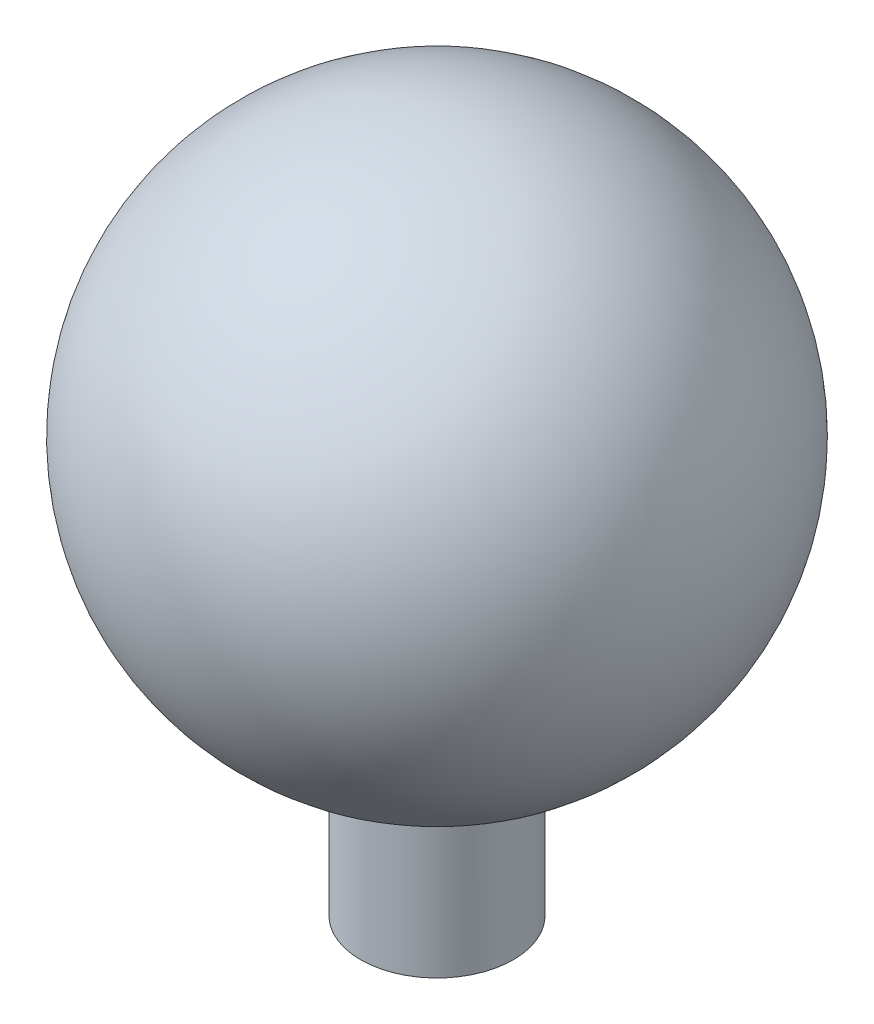
ISO-10303-21;
HEADER;
FILE_DESCRIPTION(('STEP AP214'),'2;1');
FILE_NAME('part.step','',(''),(''),'','','');
FILE_SCHEMA(('AUTOMOTIVE_DESIGN { 1 0 10303 214 1 1 1 1 }'));
ENDSEC;
DATA;
#1=APPLICATION_CONTEXT('core data for automotive mechanical design processes');
#2=APPLICATION_PROTOCOL_DEFINITION('international standard','automotive_design',2000,#1);
#3=PRODUCT_CONTEXT('',#1,'mechanical');
#4=PRODUCT('Part','Part','',(#3));
#5=PRODUCT_RELATED_PRODUCT_CATEGORY('part','',(#4));
#6=PRODUCT_DEFINITION_FORMATION('','',#4);
#7=PRODUCT_DEFINITION_CONTEXT('part definition',#1,'design');
#8=PRODUCT_DEFINITION('design','',#6,#7);
#9=PRODUCT_DEFINITION_SHAPE('','',#8);
#10=(LENGTH_UNIT() NAMED_UNIT(*) SI_UNIT(.MILLI.,.METRE.));
#11=(NAMED_UNIT(*) PLANE_ANGLE_UNIT() SI_UNIT($,.RADIAN.));
#12=(NAMED_UNIT(*) SI_UNIT($,.STERADIAN.) SOLID_ANGLE_UNIT());
#13=UNCERTAINTY_MEASURE_WITH_UNIT(LENGTH_MEASURE(1.E-05),#10,'distance_accuracy_value','');
#14=(GEOMETRIC_REPRESENTATION_CONTEXT(3) GLOBAL_UNCERTAINTY_ASSIGNED_CONTEXT((#13)) GLOBAL_UNIT_ASSIGNED_CONTEXT((#10,
#11,#12)) REPRESENTATION_CONTEXT('',''));
#15=CARTESIAN_POINT('',(0.,0.,0.));
#16=DIRECTION('',(0.,0.,1.));
#17=DIRECTION('',(1.,0.,0.));
#18=AXIS2_PLACEMENT_3D('',#15,#16,#17);
#19=CARTESIAN_POINT('',(0.,0.,0.));
#20=DIRECTION('',(0.,1.,0.));
#21=DIRECTION('',(1.,0.,0.));
#22=AXIS2_PLACEMENT_3D('',#19,#20,#21);
#23=SPHERICAL_SURFACE('',#22,79.5);
#24=CARTESIAN_POINT('',(0.,-76.3953532618313,0.));
#25=DIRECTION('',(0.,1.,0.));
#26=DIRECTION('',(0.,0.,1.));
#27=AXIS2_PLACEMENT_3D('',#24,#25,#26);
#28=CIRCLE('',#27,22.);
#29=CARTESIAN_POINT('',(0.,-76.3953532618313,22.));
#30=VERTEX_POINT('',#29);
#31=EDGE_CURVE('E10',#30,#30,#28,.T.);
#32=ORIENTED_EDGE('',*,*,#31,.T.);
#33=EDGE_LOOP('',(#32));
#34=FACE_BOUND('',#33,.T.);
#35=ADVANCED_FACE('F28',(#34),#23,.T.);
#36=CARTESIAN_POINT('',(0.,79.5,0.));
#37=DIRECTION('',(0.,1.,0.));
#38=DIRECTION('',(0.,0.,1.));
#39=AXIS2_PLACEMENT_3D('',#36,#37,#38);
#40=CYLINDRICAL_SURFACE('',#39,22.);
#41=ORIENTED_EDGE('',*,*,#31,.F.);
#42=EDGE_LOOP('',(#41));
#43=FACE_BOUND('',#42,.T.);
#44=CARTESIAN_POINT('',(0.,-119.5,0.));
#45=DIRECTION('',(0.,1.,0.));
#46=DIRECTION('',(0.,0.,1.));
#47=AXIS2_PLACEMENT_3D('',#44,#45,#46);
#48=CIRCLE('',#47,22.);
#49=CARTESIAN_POINT('',(0.,-119.5,22.));
#50=VERTEX_POINT('',#49);
#51=EDGE_CURVE('E34',#50,#50,#48,.T.);
#52=ORIENTED_EDGE('',*,*,#51,.T.);
#53=EDGE_LOOP('',(#52));
#54=FACE_BOUND('',#53,.T.);
#55=ADVANCED_FACE('F40',(#43,#54),#40,.T.);
#56=CARTESIAN_POINT('',(0.,-119.5,0.));
#57=DIRECTION('',(0.,1.,0.));
#58=DIRECTION('',(0.,0.,1.));
#59=AXIS2_PLACEMENT_3D('',#56,#57,#58);
#60=PLANE('',#59);
#61=ORIENTED_EDGE('',*,*,#51,.F.);
#62=EDGE_LOOP('',(#61));
#63=FACE_BOUND('',#62,.T.);
#64=ADVANCED_FACE('F42',(#63),#60,.F.);
#65=CLOSED_SHELL('',(#35,#55,#64));
#66=MANIFOLD_SOLID_BREP('B2',#65);
#67=ADVANCED_BREP_SHAPE_REPRESENTATION('',(#18,#66),#14);
#68=SHAPE_DEFINITION_REPRESENTATION(#9,#67);
ENDSEC;
END-ISO-10303-21;
